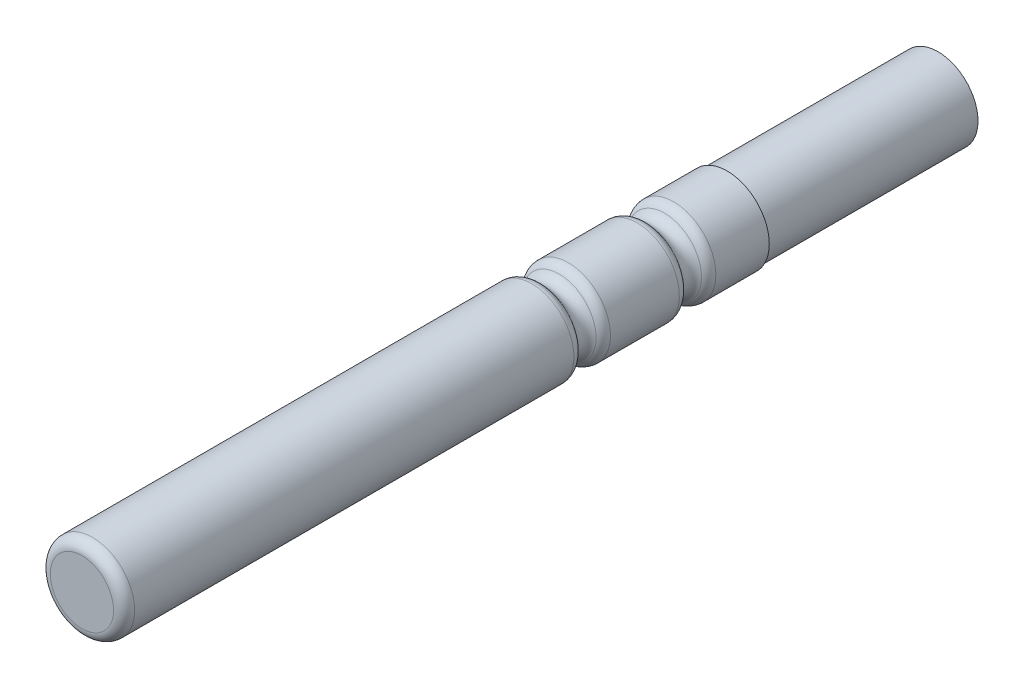
ISO-10303-21;
HEADER;
FILE_DESCRIPTION(('STEP AP214'),'2;1');
FILE_NAME('part.step','',(''),(''),'','','');
FILE_SCHEMA(('AUTOMOTIVE_DESIGN { 1 0 10303 214 1 1 1 1 }'));
ENDSEC;
DATA;
#1=APPLICATION_CONTEXT('core data for automotive mechanical design processes');
#2=APPLICATION_PROTOCOL_DEFINITION('international standard','automotive_design',2000,#1);
#3=PRODUCT_CONTEXT('',#1,'mechanical');
#4=PRODUCT('Part','Part','',(#3));
#5=PRODUCT_RELATED_PRODUCT_CATEGORY('part','',(#4));
#6=PRODUCT_DEFINITION_FORMATION('','',#4);
#7=PRODUCT_DEFINITION_CONTEXT('part definition',#1,'design');
#8=PRODUCT_DEFINITION('design','',#6,#7);
#9=PRODUCT_DEFINITION_SHAPE('','',#8);
#10=(LENGTH_UNIT() NAMED_UNIT(*) SI_UNIT(.MILLI.,.METRE.));
#11=(NAMED_UNIT(*) PLANE_ANGLE_UNIT() SI_UNIT($,.RADIAN.));
#12=(NAMED_UNIT(*) SI_UNIT($,.STERADIAN.) SOLID_ANGLE_UNIT());
#13=UNCERTAINTY_MEASURE_WITH_UNIT(LENGTH_MEASURE(1.E-05),#10,'distance_accuracy_value','');
#14=(GEOMETRIC_REPRESENTATION_CONTEXT(3) GLOBAL_UNCERTAINTY_ASSIGNED_CONTEXT((#13)) GLOBAL_UNIT_ASSIGNED_CONTEXT((#10,
#11,#12)) REPRESENTATION_CONTEXT('',''));
#15=CARTESIAN_POINT('',(0.,0.,0.));
#16=DIRECTION('',(0.,0.,1.));
#17=DIRECTION('',(1.,0.,0.));
#18=AXIS2_PLACEMENT_3D('',#15,#16,#17);
#19=CARTESIAN_POINT('',(0.,0.,30.6));
#20=DIRECTION('',(0.,0.,-1.));
#21=DIRECTION('',(-1.,0.,0.));
#22=AXIS2_PLACEMENT_3D('',#19,#20,#21);
#23=CYLINDRICAL_SURFACE('',#22,2.);
#24=CARTESIAN_POINT('',(0.,0.,2.53397459621534));
#25=DIRECTION('',(0.,0.,1.));
#26=DIRECTION('',(0.,-1.,0.));
#27=AXIS2_PLACEMENT_3D('',#24,#25,#26);
#28=CIRCLE('',#27,2.);
#29=CARTESIAN_POINT('',(0.,-2.,2.53397459621534));
#30=VERTEX_POINT('',#29);
#31=EDGE_CURVE('E83',#30,#30,#28,.F.);
#32=ORIENTED_EDGE('',*,*,#31,.T.);
#33=EDGE_LOOP('',(#32));
#34=FACE_BOUND('',#33,.T.);
#35=CARTESIAN_POINT('',(0.,0.,0.));
#36=DIRECTION('',(0.,0.,1.));
#37=DIRECTION('',(1.,0.,0.));
#38=AXIS2_PLACEMENT_3D('',#35,#36,#37);
#39=CIRCLE('',#38,2.);
#40=CARTESIAN_POINT('',(2.,0.,0.));
#41=VERTEX_POINT('',#40);
#42=EDGE_CURVE('E87',#41,#41,#39,.T.);
#43=ORIENTED_EDGE('',*,*,#42,.T.);
#44=EDGE_LOOP('',(#43));
#45=FACE_BOUND('',#44,.T.);
#46=ADVANCED_FACE('F39',(#34,#45),#23,.T.);
#47=CARTESIAN_POINT('',(0.,0.,0.));
#48=DIRECTION('',(0.,0.,1.));
#49=DIRECTION('',(1.,0.,0.));
#50=AXIS2_PLACEMENT_3D('',#47,#48,#49);
#51=PLANE('',#50);
#52=CARTESIAN_POINT('',(0.,0.,0.));
#53=DIRECTION('',(0.,0.,1.));
#54=DIRECTION('',(1.,0.,0.));
#55=AXIS2_PLACEMENT_3D('',#52,#53,#54);
#56=CIRCLE('',#55,1.9);
#57=CARTESIAN_POINT('',(1.9,0.,0.));
#58=VERTEX_POINT('',#57);
#59=EDGE_CURVE('E92',#58,#58,#56,.T.);
#60=ORIENTED_EDGE('',*,*,#59,.T.);
#61=EDGE_LOOP('',(#60));
#62=FACE_BOUND('',#61,.T.);
#63=ORIENTED_EDGE('',*,*,#42,.F.);
#64=EDGE_LOOP('',(#63));
#65=FACE_BOUND('',#64,.T.);
#66=ADVANCED_FACE('F111',(#62,#65),#51,.F.);
#67=CARTESIAN_POINT('',(0.,0.,3.4));
#68=DIRECTION('',(0.,0.,-1.));
#69=DIRECTION('',(0.,1.,0.));
#70=AXIS2_PLACEMENT_3D('',#67,#68,#69);
#71=TOROIDAL_SURFACE('',#70,2.,0.5);
#72=CARTESIAN_POINT('',(0.,0.,2.96698729810774));
#73=DIRECTION('',(0.,0.,1.));
#74=DIRECTION('',(0.,-1.,0.));
#75=AXIS2_PLACEMENT_3D('',#72,#73,#74);
#76=CIRCLE('',#75,1.75000000000008);
#77=CARTESIAN_POINT('',(0.,-1.75000000000008,2.96698729810774));
#78=VERTEX_POINT('',#77);
#79=EDGE_CURVE('E75',#78,#78,#76,.T.);
#80=ORIENTED_EDGE('',*,*,#79,.T.);
#81=EDGE_LOOP('',(#80));
#82=FACE_BOUND('',#81,.T.);
#83=CARTESIAN_POINT('',(0.,0.,3.83301270189226));
#84=DIRECTION('',(0.,0.,-1.));
#85=DIRECTION('',(0.,1.,0.));
#86=AXIS2_PLACEMENT_3D('',#83,#84,#85);
#87=CIRCLE('',#86,1.75000000000008);
#88=CARTESIAN_POINT('',(0.,1.75000000000008,3.83301270189226));
#89=VERTEX_POINT('',#88);
#90=EDGE_CURVE('E79',#89,#89,#87,.T.);
#91=ORIENTED_EDGE('',*,*,#90,.T.);
#92=EDGE_LOOP('',(#91));
#93=FACE_BOUND('',#92,.T.);
#94=ADVANCED_FACE('F119',(#82,#93),#71,.F.);
#95=CARTESIAN_POINT('',(0.,0.,4.26602540378466));
#96=DIRECTION('',(0.,0.,-1.));
#97=DIRECTION('',(0.,1.,0.));
#98=AXIS2_PLACEMENT_3D('',#95,#96,#97);
#99=CIRCLE('',#98,2.);
#100=CARTESIAN_POINT('',(0.,2.,4.26602540378466));
#101=VERTEX_POINT('',#100);
#102=EDGE_CURVE('E67',#101,#101,#99,.F.);
#103=ORIENTED_EDGE('',*,*,#102,.T.);
#104=EDGE_LOOP('',(#103));
#105=FACE_BOUND('',#104,.T.);
#106=CARTESIAN_POINT('',(0.,0.,7.53397459621534));
#107=DIRECTION('',(0.,0.,1.));
#108=DIRECTION('',(0.,-1.,0.));
#109=AXIS2_PLACEMENT_3D('',#106,#107,#108);
#110=CIRCLE('',#109,2.);
#111=CARTESIAN_POINT('',(0.,-2.,7.53397459621534));
#112=VERTEX_POINT('',#111);
#113=EDGE_CURVE('E71',#112,#112,#110,.F.);
#114=ORIENTED_EDGE('',*,*,#113,.T.);
#115=EDGE_LOOP('',(#114));
#116=FACE_BOUND('',#115,.T.);
#117=ADVANCED_FACE('F114',(#105,#116),#23,.T.);
#118=CARTESIAN_POINT('',(0.,0.,8.4));
#119=DIRECTION('',(0.,0.,-1.));
#120=DIRECTION('',(0.,1.,0.));
#121=AXIS2_PLACEMENT_3D('',#118,#119,#120);
#122=TOROIDAL_SURFACE('',#121,2.,0.500000000000001);
#123=CARTESIAN_POINT('',(0.,0.,7.96698729810773));
#124=DIRECTION('',(0.,0.,1.));
#125=DIRECTION('',(0.,-1.,0.));
#126=AXIS2_PLACEMENT_3D('',#123,#124,#125);
#127=CIRCLE('',#126,1.75000000000007);
#128=CARTESIAN_POINT('',(0.,-1.75000000000008,7.96698729810773));
#129=VERTEX_POINT('',#128);
#130=EDGE_CURVE('E57',#129,#129,#127,.T.);
#131=ORIENTED_EDGE('',*,*,#130,.T.);
#132=EDGE_LOOP('',(#131));
#133=FACE_BOUND('',#132,.T.);
#134=CARTESIAN_POINT('',(0.,0.,8.83301270189227));
#135=DIRECTION('',(0.,0.,-1.));
#136=DIRECTION('',(0.,1.,0.));
#137=AXIS2_PLACEMENT_3D('',#134,#135,#136);
#138=CIRCLE('',#137,1.75000000000007);
#139=CARTESIAN_POINT('',(0.,1.75000000000007,8.83301270189227));
#140=VERTEX_POINT('',#139);
#141=EDGE_CURVE('E63',#140,#140,#138,.T.);
#142=ORIENTED_EDGE('',*,*,#141,.T.);
#143=EDGE_LOOP('',(#142));
#144=FACE_BOUND('',#143,.T.);
#145=ADVANCED_FACE('F125',(#133,#144),#122,.F.);
#146=CARTESIAN_POINT('',(0.,0.,30.6));
#147=DIRECTION('',(0.,0.,1.));
#148=DIRECTION('',(1.,0.,0.));
#149=AXIS2_PLACEMENT_3D('',#146,#147,#148);
#150=PLANE('',#149);
#151=CARTESIAN_POINT('',(0.,0.,30.6));
#152=DIRECTION('',(0.,0.,1.));
#153=DIRECTION('',(1.,0.,0.));
#154=AXIS2_PLACEMENT_3D('',#151,#152,#153);
#155=CIRCLE('',#154,1.5);
#156=CARTESIAN_POINT('',(1.5,0.,30.6));
#157=VERTEX_POINT('',#156);
#158=EDGE_CURVE('E10',#157,#157,#155,.T.);
#159=ORIENTED_EDGE('',*,*,#158,.T.);
#160=EDGE_LOOP('',(#159));
#161=FACE_BOUND('',#160,.T.);
#162=ADVANCED_FACE('F129',(#161),#150,.T.);
#163=CARTESIAN_POINT('',(0.,0.,9.26602540378466));
#164=DIRECTION('',(0.,0.,-1.));
#165=DIRECTION('',(0.,1.,0.));
#166=AXIS2_PLACEMENT_3D('',#163,#164,#165);
#167=CIRCLE('',#166,2.);
#168=CARTESIAN_POINT('',(0.,2.,9.26602540378466));
#169=VERTEX_POINT('',#168);
#170=EDGE_CURVE('E47',#169,#169,#167,.F.);
#171=ORIENTED_EDGE('',*,*,#170,.T.);
#172=EDGE_LOOP('',(#171));
#173=FACE_BOUND('',#172,.T.);
#174=CARTESIAN_POINT('',(0.,0.,30.1));
#175=DIRECTION('',(0.,0.,1.));
#176=DIRECTION('',(1.,0.,0.));
#177=AXIS2_PLACEMENT_3D('',#174,#175,#176);
#178=CIRCLE('',#177,2.);
#179=CARTESIAN_POINT('',(2.,0.,30.1));
#180=VERTEX_POINT('',#179);
#181=EDGE_CURVE('E52',#180,#180,#178,.F.);
#182=ORIENTED_EDGE('',*,*,#181,.T.);
#183=EDGE_LOOP('',(#182));
#184=FACE_BOUND('',#183,.T.);
#185=ADVANCED_FACE('F115',(#173,#184),#23,.T.);
#186=CARTESIAN_POINT('',(0.,0.,2.53397459621534));
#187=DIRECTION('',(0.,0.,1.));
#188=DIRECTION('',(0.,-1.,0.));
#189=AXIS2_PLACEMENT_3D('',#186,#187,#188);
#190=TOROIDAL_SURFACE('',#189,1.50000000000008,0.5);
#191=ORIENTED_EDGE('',*,*,#79,.F.);
#192=EDGE_LOOP('',(#191));
#193=FACE_BOUND('',#192,.T.);
#194=ORIENTED_EDGE('',*,*,#31,.F.);
#195=EDGE_LOOP('',(#194));
#196=FACE_BOUND('',#195,.T.);
#197=ADVANCED_FACE('F128',(#193,#196),#190,.T.);
#198=CARTESIAN_POINT('',(0.,0.,4.26602540378466));
#199=DIRECTION('',(0.,0.,-1.));
#200=DIRECTION('',(0.,1.,0.));
#201=AXIS2_PLACEMENT_3D('',#198,#199,#200);
#202=TOROIDAL_SURFACE('',#201,1.50000000000008,0.5);
#203=ORIENTED_EDGE('',*,*,#90,.F.);
#204=EDGE_LOOP('',(#203));
#205=FACE_BOUND('',#204,.T.);
#206=ORIENTED_EDGE('',*,*,#102,.F.);
#207=EDGE_LOOP('',(#206));
#208=FACE_BOUND('',#207,.T.);
#209=ADVANCED_FACE('F134',(#205,#208),#202,.T.);
#210=CARTESIAN_POINT('',(0.,0.,7.53397459621534));
#211=DIRECTION('',(0.,0.,1.));
#212=DIRECTION('',(0.,-1.,0.));
#213=AXIS2_PLACEMENT_3D('',#210,#211,#212);
#214=TOROIDAL_SURFACE('',#213,1.50000000000008,0.5);
#215=ORIENTED_EDGE('',*,*,#130,.F.);
#216=EDGE_LOOP('',(#215));
#217=FACE_BOUND('',#216,.T.);
#218=ORIENTED_EDGE('',*,*,#113,.F.);
#219=EDGE_LOOP('',(#218));
#220=FACE_BOUND('',#219,.T.);
#221=ADVANCED_FACE('F146',(#217,#220),#214,.T.);
#222=CARTESIAN_POINT('',(0.,0.,9.26602540378466));
#223=DIRECTION('',(0.,0.,-1.));
#224=DIRECTION('',(0.,1.,0.));
#225=AXIS2_PLACEMENT_3D('',#222,#223,#224);
#226=TOROIDAL_SURFACE('',#225,1.50000000000008,0.5);
#227=ORIENTED_EDGE('',*,*,#141,.F.);
#228=EDGE_LOOP('',(#227));
#229=FACE_BOUND('',#228,.T.);
#230=ORIENTED_EDGE('',*,*,#170,.F.);
#231=EDGE_LOOP('',(#230));
#232=FACE_BOUND('',#231,.T.);
#233=ADVANCED_FACE('F142',(#229,#232),#226,.T.);
#234=CARTESIAN_POINT('',(0.,0.,30.1));
#235=DIRECTION('',(0.,0.,1.));
#236=DIRECTION('',(1.,0.,0.));
#237=AXIS2_PLACEMENT_3D('',#234,#235,#236);
#238=TOROIDAL_SURFACE('',#237,1.5,0.5);
#239=ORIENTED_EDGE('',*,*,#181,.F.);
#240=EDGE_LOOP('',(#239));
#241=FACE_BOUND('',#240,.T.);
#242=ORIENTED_EDGE('',*,*,#158,.F.);
#243=EDGE_LOOP('',(#242));
#244=FACE_BOUND('',#243,.T.);
#245=ADVANCED_FACE('F41',(#241,#244),#238,.T.);
#246=CARTESIAN_POINT('',(0.,0.,-10.));
#247=DIRECTION('',(0.,0.,1.));
#248=DIRECTION('',(1.,0.,0.));
#249=AXIS2_PLACEMENT_3D('',#246,#247,#248);
#250=CYLINDRICAL_SURFACE('',#249,1.9);
#251=CARTESIAN_POINT('',(0.,0.,-10.));
#252=DIRECTION('',(0.,0.,1.));
#253=DIRECTION('',(1.,0.,0.));
#254=AXIS2_PLACEMENT_3D('',#251,#252,#253);
#255=CIRCLE('',#254,1.9);
#256=CARTESIAN_POINT('',(1.9,0.,-10.));
#257=VERTEX_POINT('',#256);
#258=EDGE_CURVE('E91',#257,#257,#255,.T.);
#259=ORIENTED_EDGE('',*,*,#258,.T.);
#260=EDGE_LOOP('',(#259));
#261=FACE_BOUND('',#260,.T.);
#262=ORIENTED_EDGE('',*,*,#59,.F.);
#263=EDGE_LOOP('',(#262));
#264=FACE_BOUND('',#263,.T.);
#265=ADVANCED_FACE('F100',(#261,#264),#250,.T.);
#266=CARTESIAN_POINT('',(0.,0.,-10.));
#267=DIRECTION('',(0.,0.,1.));
#268=DIRECTION('',(1.,0.,0.));
#269=AXIS2_PLACEMENT_3D('',#266,#267,#268);
#270=PLANE('',#269);
#271=ORIENTED_EDGE('',*,*,#258,.F.);
#272=EDGE_LOOP('',(#271));
#273=FACE_BOUND('',#272,.T.);
#274=ADVANCED_FACE('F103',(#273),#270,.F.);
#275=CLOSED_SHELL('',(#46,#66,#94,#117,#145,#162,#185,#197,#209,#221,#233,#245,#265,#274));
#276=MANIFOLD_SOLID_BREP('B2',#275);
#277=ADVANCED_BREP_SHAPE_REPRESENTATION('',(#18,#276),#14);
#278=SHAPE_DEFINITION_REPRESENTATION(#9,#277);
ENDSEC;
END-ISO-10303-21;
